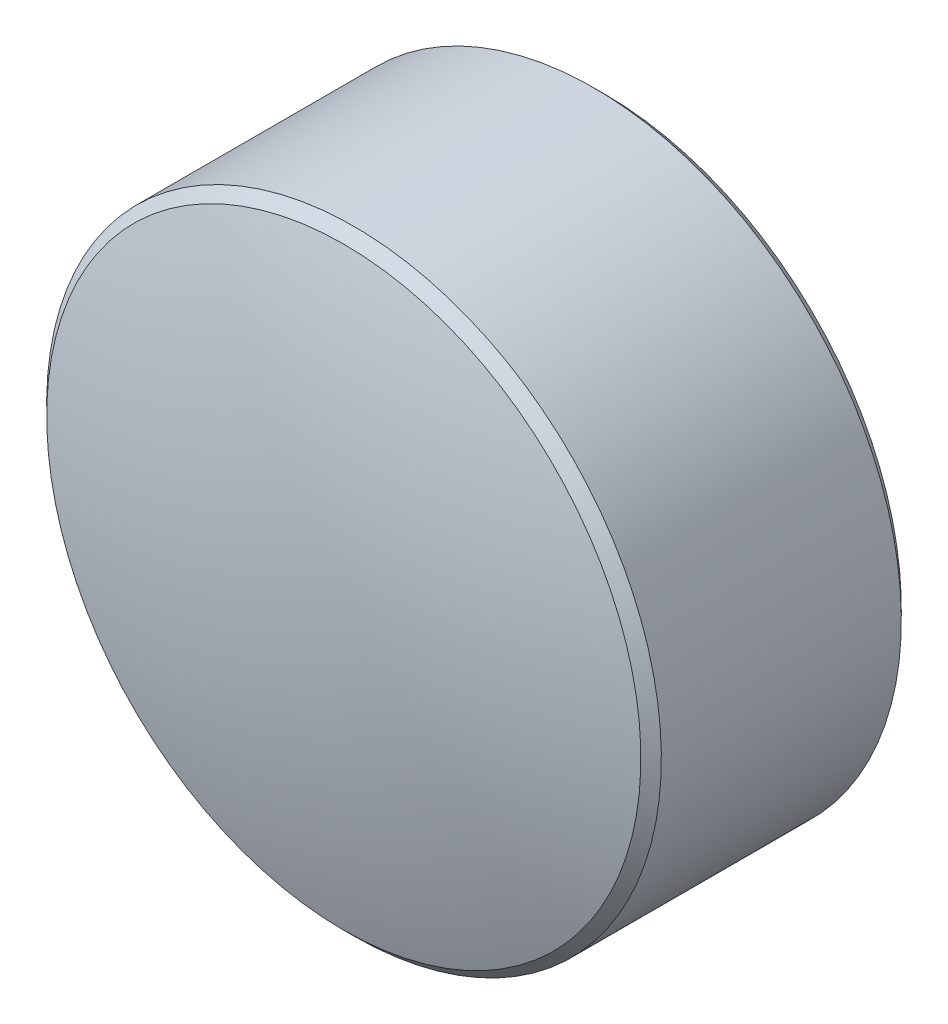
ISO-10303-21;
HEADER;
FILE_DESCRIPTION(('STEP AP214'),'2;1');
FILE_NAME('part.step','',(''),(''),'','','');
FILE_SCHEMA(('AUTOMOTIVE_DESIGN { 1 0 10303 214 1 1 1 1 }'));
ENDSEC;
DATA;
#1=APPLICATION_CONTEXT('core data for automotive mechanical design processes');
#2=APPLICATION_PROTOCOL_DEFINITION('international standard','automotive_design',2000,#1);
#3=PRODUCT_CONTEXT('',#1,'mechanical');
#4=PRODUCT('Part','Part','',(#3));
#5=PRODUCT_RELATED_PRODUCT_CATEGORY('part','',(#4));
#6=PRODUCT_DEFINITION_FORMATION('','',#4);
#7=PRODUCT_DEFINITION_CONTEXT('part definition',#1,'design');
#8=PRODUCT_DEFINITION('design','',#6,#7);
#9=PRODUCT_DEFINITION_SHAPE('','',#8);
#10=(LENGTH_UNIT() NAMED_UNIT(*) SI_UNIT(.MILLI.,.METRE.));
#11=(NAMED_UNIT(*) PLANE_ANGLE_UNIT() SI_UNIT($,.RADIAN.));
#12=(NAMED_UNIT(*) SI_UNIT($,.STERADIAN.) SOLID_ANGLE_UNIT());
#13=UNCERTAINTY_MEASURE_WITH_UNIT(LENGTH_MEASURE(1.E-05),#10,'distance_accuracy_value','');
#14=(GEOMETRIC_REPRESENTATION_CONTEXT(3) GLOBAL_UNCERTAINTY_ASSIGNED_CONTEXT((#13)) GLOBAL_UNIT_ASSIGNED_CONTEXT((#10,
#11,#12)) REPRESENTATION_CONTEXT('',''));
#15=CARTESIAN_POINT('',(0.,0.,0.));
#16=DIRECTION('',(0.,0.,1.));
#17=DIRECTION('',(1.,0.,0.));
#18=AXIS2_PLACEMENT_3D('',#15,#16,#17);
#19=CARTESIAN_POINT('',(0.722158472780845,0.905568395087644,2.2109883731853));
#20=DIRECTION('',(0.,0.,1.));
#21=DIRECTION('',(0.,-1.,0.));
#22=AXIS2_PLACEMENT_3D('',#19,#20,#21);
#23=PLANE('',#22);
#24=CARTESIAN_POINT('',(0.722158472780845,0.905568395087644,2.2109883731853));
#25=DIRECTION('',(0.,0.,1.));
#26=DIRECTION('',(0.,-1.,0.));
#27=AXIS2_PLACEMENT_3D('',#24,#25,#26);
#28=CIRCLE('',#27,1.45);
#29=CARTESIAN_POINT('',(0.722158472780845,-0.544431604912356,2.2109883731853));
#30=VERTEX_POINT('',#29);
#31=EDGE_CURVE('E9',#30,#30,#28,.F.);
#32=ORIENTED_EDGE('',*,*,#31,.T.);
#33=EDGE_LOOP('',(#32));
#34=FACE_BOUND('',#33,.T.);
#35=ADVANCED_FACE('F13',(#34),#23,.F.);
#36=CARTESIAN_POINT('',(0.722158472780845,0.905568395087644,3.7109883731853));
#37=DIRECTION('',(0.,0.,1.));
#38=DIRECTION('',(0.,-1.,0.));
#39=AXIS2_PLACEMENT_3D('',#36,#37,#38);
#40=CYLINDRICAL_SURFACE('',#39,1.5);
#41=CARTESIAN_POINT('',(0.722158472780845,0.905568395087644,2.2609883731853));
#42=DIRECTION('',(0.,0.,1.));
#43=DIRECTION('',(0.,-1.,0.));
#44=AXIS2_PLACEMENT_3D('',#41,#42,#43);
#45=CIRCLE('',#44,1.5);
#46=CARTESIAN_POINT('',(0.722158472780845,-0.594431604912356,2.2609883731853));
#47=VERTEX_POINT('',#46);
#48=EDGE_CURVE('E20',#47,#47,#45,.T.);
#49=ORIENTED_EDGE('',*,*,#48,.T.);
#50=EDGE_LOOP('',(#49));
#51=FACE_BOUND('',#50,.T.);
#52=CARTESIAN_POINT('',(0.722158472780845,0.905568395087644,3.43213605996679));
#53=DIRECTION('',(0.,0.,1.));
#54=DIRECTION('',(0.,-1.,0.));
#55=AXIS2_PLACEMENT_3D('',#52,#53,#54);
#56=CIRCLE('',#55,1.5);
#57=CARTESIAN_POINT('',(0.722158472780845,-0.594431604912356,3.43213605996679));
#58=VERTEX_POINT('',#57);
#59=EDGE_CURVE('E24',#58,#58,#56,.T.);
#60=ORIENTED_EDGE('',*,*,#59,.F.);
#61=EDGE_LOOP('',(#60));
#62=FACE_BOUND('',#61,.T.);
#63=ADVANCED_FACE('F39',(#51,#62),#40,.T.);
#64=CARTESIAN_POINT('',(0.722158472780845,0.905568395087644,3.43213605996679));
#65=DIRECTION('',(0.,0.,-1.));
#66=DIRECTION('',(0.,1.,0.));
#67=AXIS2_PLACEMENT_3D('',#64,#65,#66);
#68=CONICAL_SURFACE('',#67,1.5,0.785398163397453);
#69=CARTESIAN_POINT('',(0.722158472780845,0.905568395087644,3.48213605996679));
#70=DIRECTION('',(0.,0.,1.));
#71=DIRECTION('',(0.,-1.,0.));
#72=AXIS2_PLACEMENT_3D('',#69,#70,#71);
#73=CIRCLE('',#72,1.45);
#74=CARTESIAN_POINT('',(0.722158472780845,-0.544431604912356,3.48213605996679));
#75=VERTEX_POINT('',#74);
#76=EDGE_CURVE('E28',#75,#75,#73,.T.);
#77=ORIENTED_EDGE('',*,*,#76,.F.);
#78=EDGE_LOOP('',(#77));
#79=FACE_BOUND('',#78,.T.);
#80=ORIENTED_EDGE('',*,*,#59,.T.);
#81=EDGE_LOOP('',(#80));
#82=FACE_BOUND('',#81,.T.);
#83=ADVANCED_FACE('F36',(#79,#82),#68,.T.);
#84=CARTESIAN_POINT('',(0.722158472780845,0.905568395087644,-0.997011626814703));
#85=DIRECTION('',(0.,0.,1.));
#86=DIRECTION('',(0.,1.,0.));
#87=AXIS2_PLACEMENT_3D('',#84,#85,#86);
#88=SPHERICAL_SURFACE('',#87,4.708);
#89=ORIENTED_EDGE('',*,*,#76,.T.);
#90=EDGE_LOOP('',(#89));
#91=FACE_BOUND('',#90,.T.);
#92=ADVANCED_FACE('F34',(#91),#88,.T.);
#93=CARTESIAN_POINT('',(0.722158472780845,0.905568395087644,2.2609883731853));
#94=DIRECTION('',(0.,0.,1.));
#95=DIRECTION('',(0.,-1.,0.));
#96=AXIS2_PLACEMENT_3D('',#93,#94,#95);
#97=CONICAL_SURFACE('',#96,1.5,0.785398163397446);
#98=ORIENTED_EDGE('',*,*,#31,.F.);
#99=EDGE_LOOP('',(#98));
#100=FACE_BOUND('',#99,.T.);
#101=ORIENTED_EDGE('',*,*,#48,.F.);
#102=EDGE_LOOP('',(#101));
#103=FACE_BOUND('',#102,.T.);
#104=ADVANCED_FACE('F15',(#100,#103),#97,.T.);
#105=CLOSED_SHELL('',(#35,#63,#83,#92,#104));
#106=MANIFOLD_SOLID_BREP('B1',#105);
#107=ADVANCED_BREP_SHAPE_REPRESENTATION('',(#18,#106),#14);
#108=SHAPE_DEFINITION_REPRESENTATION(#9,#107);
ENDSEC;
END-ISO-10303-21;
